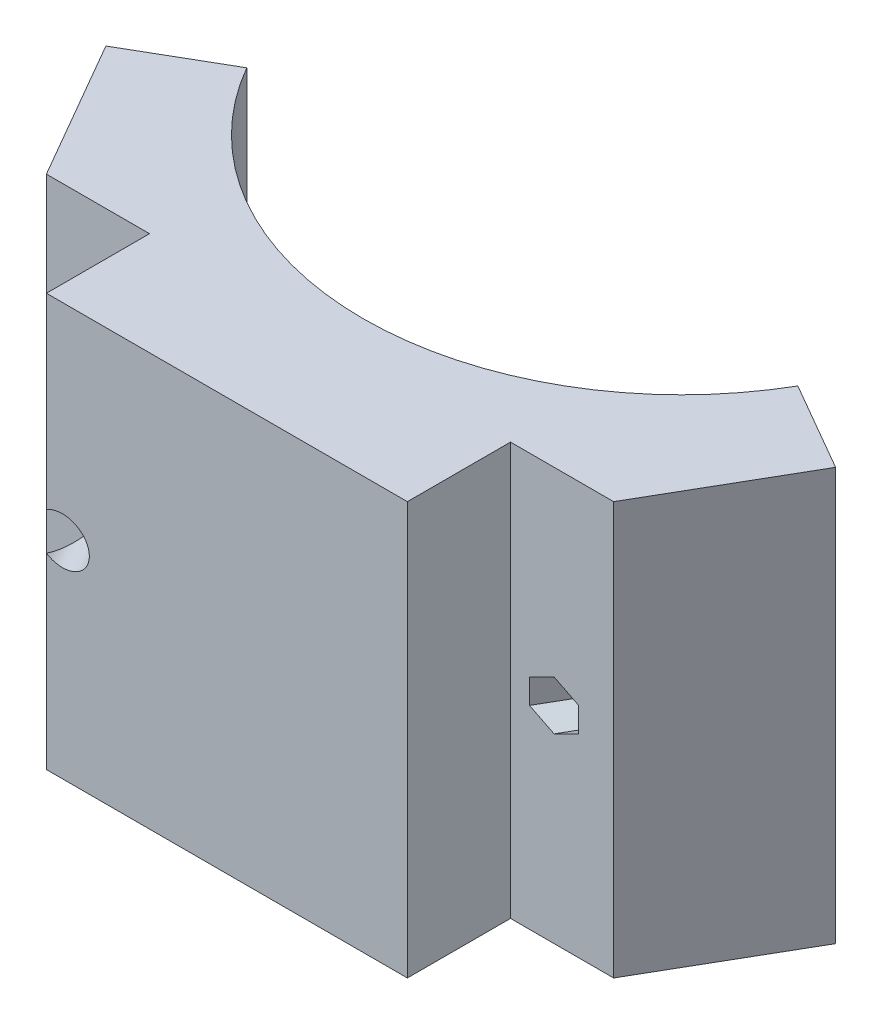
ISO-10303-21;
HEADER;
FILE_DESCRIPTION(('STEP AP214'),'2;1');
FILE_NAME('part.step','',(''),(''),'','','');
FILE_SCHEMA(('AUTOMOTIVE_DESIGN { 1 0 10303 214 1 1 1 1 }'));
ENDSEC;
DATA;
#1=APPLICATION_CONTEXT('core data for automotive mechanical design processes');
#2=APPLICATION_PROTOCOL_DEFINITION('international standard','automotive_design',2000,#1);
#3=PRODUCT_CONTEXT('',#1,'mechanical');
#4=PRODUCT('Part','Part','',(#3));
#5=PRODUCT_RELATED_PRODUCT_CATEGORY('part','',(#4));
#6=PRODUCT_DEFINITION_FORMATION('','',#4);
#7=PRODUCT_DEFINITION_CONTEXT('part definition',#1,'design');
#8=PRODUCT_DEFINITION('design','',#6,#7);
#9=PRODUCT_DEFINITION_SHAPE('','',#8);
#10=(LENGTH_UNIT() NAMED_UNIT(*) SI_UNIT(.MILLI.,.METRE.));
#11=(NAMED_UNIT(*) PLANE_ANGLE_UNIT() SI_UNIT($,.RADIAN.));
#12=(NAMED_UNIT(*) SI_UNIT($,.STERADIAN.) SOLID_ANGLE_UNIT());
#13=UNCERTAINTY_MEASURE_WITH_UNIT(LENGTH_MEASURE(1.E-05),#10,'distance_accuracy_value','');
#14=(GEOMETRIC_REPRESENTATION_CONTEXT(3) GLOBAL_UNCERTAINTY_ASSIGNED_CONTEXT((#13)) GLOBAL_UNIT_ASSIGNED_CONTEXT((#10,
#11,#12)) REPRESENTATION_CONTEXT('',''));
#15=CARTESIAN_POINT('',(0.,0.,0.));
#16=DIRECTION('',(0.,0.,1.));
#17=DIRECTION('',(1.,0.,0.));
#18=AXIS2_PLACEMENT_3D('',#15,#16,#17);
#19=CARTESIAN_POINT('',(0.,50.8,0.));
#20=DIRECTION('',(0.,-1.,0.));
#21=DIRECTION('',(0.,0.,-1.));
#22=AXIS2_PLACEMENT_3D('',#19,#20,#21);
#23=CYLINDRICAL_SURFACE('',#22,78.359);
#24=CARTESIAN_POINT('',(0.,-50.8,0.));
#25=DIRECTION('',(0.,1.,0.));
#26=DIRECTION('',(0.,0.,1.));
#27=AXIS2_PLACEMENT_3D('',#24,#25,#26);
#28=CIRCLE('',#27,78.359);
#29=CARTESIAN_POINT('',(-67.8608846151449,-50.8,39.1794999999998));
#30=VERTEX_POINT('',#29);
#31=CARTESIAN_POINT('',(67.8608846151449,-50.8,39.1794999999998));
#32=VERTEX_POINT('',#31);
#33=EDGE_CURVE('E289',#30,#32,#28,.T.);
#34=ORIENTED_EDGE('',*,*,#33,.F.);
#35=DIRECTION('',(0.,-1.,0.));
#36=VECTOR('',#35,1.);
#37=CARTESIAN_POINT('',(-67.8608846151449,50.8,39.1794999999998));
#38=LINE('',#37,#36);
#39=CARTESIAN_POINT('',(-67.8608846151449,50.8,39.1794999999998));
#40=VERTEX_POINT('',#39);
#41=EDGE_CURVE('E53',#40,#30,#38,.T.);
#42=ORIENTED_EDGE('',*,*,#41,.F.);
#43=CARTESIAN_POINT('',(0.,50.8,0.));
#44=DIRECTION('',(0.,1.,0.));
#45=DIRECTION('',(0.,0.,1.));
#46=AXIS2_PLACEMENT_3D('',#43,#44,#45);
#47=CIRCLE('',#46,78.359);
#48=CARTESIAN_POINT('',(67.8608846151449,50.8,39.1794999999998));
#49=VERTEX_POINT('',#48);
#50=EDGE_CURVE('E290',#40,#49,#47,.T.);
#51=ORIENTED_EDGE('',*,*,#50,.T.);
#52=DIRECTION('',(0.,-1.,0.));
#53=VECTOR('',#52,1.);
#54=CARTESIAN_POINT('',(67.8608846151449,50.8,39.1794999999998));
#55=LINE('',#54,#53);
#56=EDGE_CURVE('E325',#49,#32,#55,.T.);
#57=ORIENTED_EDGE('',*,*,#56,.T.);
#58=EDGE_LOOP('',(#34,#42,#51,#57));
#59=FACE_BOUND('',#58,.T.);
#60=ADVANCED_FACE('F45',(#59),#23,.F.);
#61=CARTESIAN_POINT('',(0.,50.8,-1.62249976663613E-13));
#62=DIRECTION('',(0.5,0.,0.866025403784439));
#63=DIRECTION('',(0.866025403784439,0.,-0.5));
#64=AXIS2_PLACEMENT_3D('',#61,#62,#63);
#65=PLANE('',#64);
#66=CARTESIAN_POINT('',(-78.8594072432072,0.,45.5295));
#67=DIRECTION('',(-0.5,0.,-0.866025403784439));
#68=DIRECTION('',(-0.866025403784439,0.,0.5));
#69=AXIS2_PLACEMENT_3D('',#66,#67,#68);
#70=CIRCLE('',#69,3.50000000000001);
#71=CARTESIAN_POINT('',(-81.8904961564528,0.,47.2795));
#72=VERTEX_POINT('',#71);
#73=EDGE_CURVE('E213',#72,#72,#70,.T.);
#74=ORIENTED_EDGE('',*,*,#73,.F.);
#75=EDGE_LOOP('',(#74));
#76=FACE_BOUND('',#75,.T.);
#77=DIRECTION('',(-0.866025403784439,0.,0.5));
#78=VECTOR('',#77,1.);
#79=CARTESIAN_POINT('',(0.,-50.8,-1.62249976663613E-13));
#80=LINE('',#79,#78);
#81=CARTESIAN_POINT('',(-89.8579298712697,-50.8,51.8794999999998));
#82=VERTEX_POINT('',#81);
#83=EDGE_CURVE('E329',#30,#82,#80,.T.);
#84=ORIENTED_EDGE('',*,*,#83,.T.);
#85=DIRECTION('',(0.,-1.,0.));
#86=VECTOR('',#85,1.);
#87=CARTESIAN_POINT('',(-89.8579298712697,50.8,51.8794999999998));
#88=LINE('',#87,#86);
#89=CARTESIAN_POINT('',(-89.8579298712697,50.8,51.8794999999998));
#90=VERTEX_POINT('',#89);
#91=EDGE_CURVE('E194',#90,#82,#88,.T.);
#92=ORIENTED_EDGE('',*,*,#91,.F.);
#93=DIRECTION('',(-0.866025403784439,0.,0.5));
#94=VECTOR('',#93,1.);
#95=CARTESIAN_POINT('',(0.,50.8,-1.62249976663613E-13));
#96=LINE('',#95,#94);
#97=EDGE_CURVE('E294',#40,#90,#96,.T.);
#98=ORIENTED_EDGE('',*,*,#97,.F.);
#99=ORIENTED_EDGE('',*,*,#41,.T.);
#100=EDGE_LOOP('',(#84,#92,#98,#99));
#101=FACE_BOUND('',#100,.T.);
#102=ADVANCED_FACE('F399',(#76,#101),#65,.F.);
#103=CARTESIAN_POINT('',(-89.8579298712696,50.8,51.8795));
#104=DIRECTION('',(0.866025403784439,0.,-0.5));
#105=DIRECTION('',(-0.5,0.,-0.866025403784439));
#106=AXIS2_PLACEMENT_3D('',#103,#104,#105);
#107=PLANE('',#106);
#108=DIRECTION('',(0.5,0.,0.866025403784439));
#109=VECTOR('',#108,1.);
#110=CARTESIAN_POINT('',(-89.8579298712696,-50.8,51.8795));
#111=LINE('',#110,#109);
#112=CARTESIAN_POINT('',(-69.85,-50.8,86.5342510913139));
#113=VERTEX_POINT('',#112);
#114=EDGE_CURVE('E332',#82,#113,#111,.T.);
#115=ORIENTED_EDGE('',*,*,#114,.T.);
#116=DIRECTION('',(0.,-1.,0.));
#117=VECTOR('',#116,1.);
#118=CARTESIAN_POINT('',(-69.85,50.8,86.5342510913139));
#119=LINE('',#118,#117);
#120=CARTESIAN_POINT('',(-69.85,50.8,86.5342510913139));
#121=VERTEX_POINT('',#120);
#122=EDGE_CURVE('E185',#121,#113,#119,.T.);
#123=ORIENTED_EDGE('',*,*,#122,.F.);
#124=DIRECTION('',(0.5,0.,0.866025403784439));
#125=VECTOR('',#124,1.);
#126=CARTESIAN_POINT('',(-89.8579298712696,50.8,51.8795));
#127=LINE('',#126,#125);
#128=EDGE_CURVE('E298',#90,#121,#127,.T.);
#129=ORIENTED_EDGE('',*,*,#128,.F.);
#130=ORIENTED_EDGE('',*,*,#91,.T.);
#131=EDGE_LOOP('',(#115,#123,#129,#130));
#132=FACE_BOUND('',#131,.T.);
#133=ADVANCED_FACE('F404',(#132),#107,.F.);
#134=CARTESIAN_POINT('',(0.,50.8,86.5342510913139));
#135=DIRECTION('',(0.,0.,-1.));
#136=DIRECTION('',(-1.,0.,0.));
#137=AXIS2_PLACEMENT_3D('',#134,#135,#136);
#138=PLANE('',#137);
#139=CARTESIAN_POINT('',(-55.1853031625835,0.,86.5342510913139));
#140=DIRECTION('',(0.,0.,-1.));
#141=DIRECTION('',(-1.,0.,0.));
#142=AXIS2_PLACEMENT_3D('',#139,#140,#141);
#143=ELLIPSE('',#142,6.63952809568071,5.75000000000001);
#144=CARTESIAN_POINT('',(-61.8248312582642,0.,86.5342510913139));
#145=VERTEX_POINT('',#144);
#146=EDGE_CURVE('E173',#145,#145,#143,.T.);
#147=ORIENTED_EDGE('',*,*,#146,.T.);
#148=EDGE_LOOP('',(#147));
#149=FACE_BOUND('',#148,.T.);
#150=DIRECTION('',(1.,0.,0.));
#151=VECTOR('',#150,1.);
#152=CARTESIAN_POINT('',(0.,-50.8,86.5342510913139));
#153=LINE('',#152,#151);
#154=CARTESIAN_POINT('',(-44.45,-50.8,86.5342510913139));
#155=VERTEX_POINT('',#154);
#156=EDGE_CURVE('E335',#113,#155,#153,.T.);
#157=ORIENTED_EDGE('',*,*,#156,.T.);
#158=DIRECTION('',(0.,-1.,0.));
#159=VECTOR('',#158,1.);
#160=CARTESIAN_POINT('',(-44.45,50.8,86.5342510913139));
#161=LINE('',#160,#159);
#162=CARTESIAN_POINT('',(-44.45,50.8,86.5342510913139));
#163=VERTEX_POINT('',#162);
#164=EDGE_CURVE('E180',#163,#155,#161,.T.);
#165=ORIENTED_EDGE('',*,*,#164,.F.);
#166=DIRECTION('',(1.,0.,0.));
#167=VECTOR('',#166,1.);
#168=CARTESIAN_POINT('',(0.,50.8,86.5342510913139));
#169=LINE('',#168,#167);
#170=EDGE_CURVE('E301',#121,#163,#169,.T.);
#171=ORIENTED_EDGE('',*,*,#170,.F.);
#172=ORIENTED_EDGE('',*,*,#122,.T.);
#173=EDGE_LOOP('',(#157,#165,#171,#172));
#174=FACE_BOUND('',#173,.T.);
#175=ADVANCED_FACE('F408',(#149,#174),#138,.F.);
#176=CARTESIAN_POINT('',(-44.45,50.8,0.));
#177=DIRECTION('',(1.,0.,0.));
#178=DIRECTION('',(0.,0.,-1.));
#179=AXIS2_PLACEMENT_3D('',#176,#177,#178);
#180=PLANE('',#179);
#181=DIRECTION('',(0.,-1.,0.));
#182=VECTOR('',#181,1.);
#183=CARTESIAN_POINT('',(-44.45,50.8,111.934251091314));
#184=LINE('',#183,#182);
#185=CARTESIAN_POINT('',(-44.45,-4.63491089570633,111.934251091314));
#186=VERTEX_POINT('',#185);
#187=CARTESIAN_POINT('',(-44.45,-50.8,111.934251091314));
#188=VERTEX_POINT('',#187);
#189=EDGE_CURVE('E171',#186,#188,#184,.T.);
#190=ORIENTED_EDGE('',*,*,#189,.F.);
#191=CARTESIAN_POINT('',(-44.45,0.,105.128341603563));
#192=DIRECTION('',(1.,0.,0.));
#193=DIRECTION('',(0.,0.,-1.));
#194=AXIS2_PLACEMENT_3D('',#191,#192,#193);
#195=ELLIPSE('',#194,11.5,5.75000000000001);
#196=CARTESIAN_POINT('',(-44.45,4.63491089570633,111.934251091314));
#197=VERTEX_POINT('',#196);
#198=EDGE_CURVE('E59',#186,#197,#195,.T.);
#199=ORIENTED_EDGE('',*,*,#198,.T.);
#200=CARTESIAN_POINT('',(-44.45,50.8,111.934251091314));
#201=VERTEX_POINT('',#200);
#202=EDGE_CURVE('E168',#201,#197,#184,.T.);
#203=ORIENTED_EDGE('',*,*,#202,.F.);
#204=DIRECTION('',(0.,0.,1.));
#205=VECTOR('',#204,1.);
#206=CARTESIAN_POINT('',(-44.45,50.8,0.));
#207=LINE('',#206,#205);
#208=EDGE_CURVE('E304',#163,#201,#207,.T.);
#209=ORIENTED_EDGE('',*,*,#208,.F.);
#210=ORIENTED_EDGE('',*,*,#164,.T.);
#211=DIRECTION('',(0.,0.,1.));
#212=VECTOR('',#211,1.);
#213=CARTESIAN_POINT('',(-44.45,-50.8,0.));
#214=LINE('',#213,#212);
#215=EDGE_CURVE('E338',#155,#188,#214,.T.);
#216=ORIENTED_EDGE('',*,*,#215,.T.);
#217=EDGE_LOOP('',(#190,#199,#203,#209,#210,#216));
#218=FACE_BOUND('',#217,.T.);
#219=ADVANCED_FACE('F166',(#218),#180,.F.);
#220=CARTESIAN_POINT('',(0.,50.8,111.934251091314));
#221=DIRECTION('',(0.,0.,-1.));
#222=DIRECTION('',(-1.,0.,0.));
#223=AXIS2_PLACEMENT_3D('',#220,#221,#222);
#224=PLANE('',#223);
#225=ORIENTED_EDGE('',*,*,#202,.T.);
#226=CARTESIAN_POINT('',(-40.5206063251671,0.,111.934251091314));
#227=DIRECTION('',(0.,0.,-1.));
#228=DIRECTION('',(-1.,0.,0.));
#229=AXIS2_PLACEMENT_3D('',#226,#227,#228);
#230=ELLIPSE('',#229,6.63952809568071,5.75000000000001);
#231=EDGE_CURVE('E11',#197,#186,#230,.T.);
#232=ORIENTED_EDGE('',*,*,#231,.T.);
#233=ORIENTED_EDGE('',*,*,#189,.T.);
#234=DIRECTION('',(1.,0.,0.));
#235=VECTOR('',#234,1.);
#236=CARTESIAN_POINT('',(0.,-50.8,111.934251091314));
#237=LINE('',#236,#235);
#238=CARTESIAN_POINT('',(44.45,-50.8,111.934251091314));
#239=VERTEX_POINT('',#238);
#240=EDGE_CURVE('E341',#188,#239,#237,.T.);
#241=ORIENTED_EDGE('',*,*,#240,.T.);
#242=DIRECTION('',(0.,-1.,0.));
#243=VECTOR('',#242,1.);
#244=CARTESIAN_POINT('',(44.45,50.8,111.934251091314));
#245=LINE('',#244,#243);
#246=CARTESIAN_POINT('',(44.45,50.8,111.934251091314));
#247=VERTEX_POINT('',#246);
#248=EDGE_CURVE('E187',#247,#239,#245,.T.);
#249=ORIENTED_EDGE('',*,*,#248,.F.);
#250=DIRECTION('',(1.,0.,0.));
#251=VECTOR('',#250,1.);
#252=CARTESIAN_POINT('',(0.,50.8,111.934251091314));
#253=LINE('',#252,#251);
#254=EDGE_CURVE('E178',#201,#247,#253,.T.);
#255=ORIENTED_EDGE('',*,*,#254,.F.);
#256=EDGE_LOOP('',(#225,#232,#233,#241,#249,#255));
#257=FACE_BOUND('',#256,.T.);
#258=ADVANCED_FACE('F176',(#257),#224,.F.);
#259=CARTESIAN_POINT('',(44.45,50.8,0.));
#260=DIRECTION('',(1.,0.,0.));
#261=DIRECTION('',(0.,0.,-1.));
#262=AXIS2_PLACEMENT_3D('',#259,#260,#261);
#263=PLANE('',#262);
#264=DIRECTION('',(0.,0.,1.));
#265=VECTOR('',#264,1.);
#266=CARTESIAN_POINT('',(44.45,-50.8,0.));
#267=LINE('',#266,#265);
#268=CARTESIAN_POINT('',(44.45,-50.8,86.5342510913139));
#269=VERTEX_POINT('',#268);
#270=EDGE_CURVE('E345',#269,#239,#267,.T.);
#271=ORIENTED_EDGE('',*,*,#270,.F.);
#272=DIRECTION('',(0.,-1.,0.));
#273=VECTOR('',#272,1.);
#274=CARTESIAN_POINT('',(44.45,50.8,86.5342510913139));
#275=LINE('',#274,#273);
#276=CARTESIAN_POINT('',(44.45,50.8,86.5342510913139));
#277=VERTEX_POINT('',#276);
#278=EDGE_CURVE('E367',#277,#269,#275,.T.);
#279=ORIENTED_EDGE('',*,*,#278,.F.);
#280=DIRECTION('',(0.,0.,1.));
#281=VECTOR('',#280,1.);
#282=CARTESIAN_POINT('',(44.45,50.8,0.));
#283=LINE('',#282,#281);
#284=EDGE_CURVE('E309',#277,#247,#283,.T.);
#285=ORIENTED_EDGE('',*,*,#284,.T.);
#286=ORIENTED_EDGE('',*,*,#248,.T.);
#287=EDGE_LOOP('',(#271,#279,#285,#286));
#288=FACE_BOUND('',#287,.T.);
#289=ADVANCED_FACE('F374',(#288),#263,.T.);
#290=CARTESIAN_POINT('',(0.,50.8,86.5342510913139));
#291=DIRECTION('',(0.,0.,1.));
#292=DIRECTION('',(1.,0.,0.));
#293=AXIS2_PLACEMENT_3D('',#290,#291,#292);
#294=PLANE('',#293);
#295=DIRECTION('',(0.,1.,0.));
#296=VECTOR('',#295,1.);
#297=CARTESIAN_POINT('',(49.1231253360926,-3.03108891324552,86.5342510913139));
#298=LINE('',#297,#296);
#299=CARTESIAN_POINT('',(49.1231253360926,-3.03108891324552,86.5342510913139));
#300=VERTEX_POINT('',#299);
#301=CARTESIAN_POINT('',(49.1231253360926,3.03108891324553,86.5342510913139));
#302=VERTEX_POINT('',#301);
#303=EDGE_CURVE('E217',#300,#302,#298,.T.);
#304=ORIENTED_EDGE('',*,*,#303,.T.);
#305=DIRECTION('',(0.894427190999916,0.447213595499958,0.));
#306=VECTOR('',#305,1.);
#307=CARTESIAN_POINT('',(43.4237060794313,0.181379284914886,86.5342510913139));
#308=LINE('',#307,#306);
#309=CARTESIAN_POINT('',(55.1853031625836,6.06217782649107,86.5342510913139));
#310=VERTEX_POINT('',#309);
#311=EDGE_CURVE('E246',#302,#310,#308,.T.);
#312=ORIENTED_EDGE('',*,*,#311,.T.);
#313=DIRECTION('',(0.894427190999916,-0.447213595499958,0.));
#314=VECTOR('',#313,1.);
#315=CARTESIAN_POINT('',(48.2734483406241,9.51810523747082,86.5342510913139));
#316=LINE('',#315,#314);
#317=CARTESIAN_POINT('',(61.2474809890747,3.03108891324554,86.5342510913139));
#318=VERTEX_POINT('',#317);
#319=EDGE_CURVE('E270',#310,#318,#316,.T.);
#320=ORIENTED_EDGE('',*,*,#319,.T.);
#321=DIRECTION('',(0.,-1.,0.));
#322=VECTOR('',#321,1.);
#323=CARTESIAN_POINT('',(61.2474809890747,3.03108891324554,86.5342510913139));
#324=LINE('',#323,#322);
#325=CARTESIAN_POINT('',(61.2474809890747,-3.03108891324556,86.5342510913139));
#326=VERTEX_POINT('',#325);
#327=EDGE_CURVE('E265',#318,#326,#324,.T.);
#328=ORIENTED_EDGE('',*,*,#327,.T.);
#329=DIRECTION('',(-0.894427190999916,-0.447213595499957,0.));
#330=VECTOR('',#329,1.);
#331=CARTESIAN_POINT('',(53.123190601817,-7.09323410687441,86.5342510913139));
#332=LINE('',#331,#330);
#333=CARTESIAN_POINT('',(55.1853031625836,-6.06217782649108,86.5342510913139));
#334=VERTEX_POINT('',#333);
#335=EDGE_CURVE('E260',#326,#334,#332,.T.);
#336=ORIENTED_EDGE('',*,*,#335,.T.);
#337=DIRECTION('',(-0.894427190999915,0.447213595499959,0.));
#338=VECTOR('',#337,1.);
#339=CARTESIAN_POINT('',(48.2734483406241,-2.60625041551132,86.5342510913139));
#340=LINE('',#339,#338);
#341=EDGE_CURVE('E255',#334,#300,#340,.T.);
#342=ORIENTED_EDGE('',*,*,#341,.T.);
#343=EDGE_LOOP('',(#304,#312,#320,#328,#336,#342));
#344=FACE_BOUND('',#343,.T.);
#345=DIRECTION('',(-1.,0.,0.));
#346=VECTOR('',#345,1.);
#347=CARTESIAN_POINT('',(0.,-50.8,86.5342510913139));
#348=LINE('',#347,#346);
#349=CARTESIAN_POINT('',(69.85,-50.8,86.5342510913139));
#350=VERTEX_POINT('',#349);
#351=EDGE_CURVE('E349',#350,#269,#348,.T.);
#352=ORIENTED_EDGE('',*,*,#351,.F.);
#353=DIRECTION('',(0.,-1.,0.));
#354=VECTOR('',#353,1.);
#355=CARTESIAN_POINT('',(69.85,50.8,86.5342510913139));
#356=LINE('',#355,#354);
#357=CARTESIAN_POINT('',(69.85,50.8,86.5342510913139));
#358=VERTEX_POINT('',#357);
#359=EDGE_CURVE('E365',#358,#350,#356,.T.);
#360=ORIENTED_EDGE('',*,*,#359,.F.);
#361=DIRECTION('',(-1.,0.,0.));
#362=VECTOR('',#361,1.);
#363=CARTESIAN_POINT('',(0.,50.8,86.5342510913139));
#364=LINE('',#363,#362);
#365=EDGE_CURVE('E313',#358,#277,#364,.T.);
#366=ORIENTED_EDGE('',*,*,#365,.T.);
#367=ORIENTED_EDGE('',*,*,#278,.T.);
#368=EDGE_LOOP('',(#352,#360,#366,#367));
#369=FACE_BOUND('',#368,.T.);
#370=ADVANCED_FACE('F381',(#344,#369),#294,.T.);
#371=CARTESIAN_POINT('',(89.8579298712696,50.8,51.8795));
#372=DIRECTION('',(0.866025403784439,0.,0.5));
#373=DIRECTION('',(0.5,0.,-0.866025403784439));
#374=AXIS2_PLACEMENT_3D('',#371,#372,#373);
#375=PLANE('',#374);
#376=DIRECTION('',(-0.5,0.,0.866025403784439));
#377=VECTOR('',#376,1.);
#378=CARTESIAN_POINT('',(89.8579298712696,-50.8,51.8795));
#379=LINE('',#378,#377);
#380=CARTESIAN_POINT('',(89.8579298712697,-50.8,51.8794999999998));
#381=VERTEX_POINT('',#380);
#382=EDGE_CURVE('E353',#381,#350,#379,.T.);
#383=ORIENTED_EDGE('',*,*,#382,.F.);
#384=DIRECTION('',(0.,-1.,0.));
#385=VECTOR('',#384,1.);
#386=CARTESIAN_POINT('',(89.8579298712697,50.8,51.8794999999998));
#387=LINE('',#386,#385);
#388=CARTESIAN_POINT('',(89.8579298712697,50.8,51.8794999999998));
#389=VERTEX_POINT('',#388);
#390=EDGE_CURVE('E362',#389,#381,#387,.T.);
#391=ORIENTED_EDGE('',*,*,#390,.F.);
#392=DIRECTION('',(-0.5,0.,0.866025403784439));
#393=VECTOR('',#392,1.);
#394=CARTESIAN_POINT('',(89.8579298712696,50.8,51.8795));
#395=LINE('',#394,#393);
#396=EDGE_CURVE('E317',#389,#358,#395,.T.);
#397=ORIENTED_EDGE('',*,*,#396,.T.);
#398=ORIENTED_EDGE('',*,*,#359,.T.);
#399=EDGE_LOOP('',(#383,#391,#397,#398));
#400=FACE_BOUND('',#399,.T.);
#401=ADVANCED_FACE('F389',(#400),#375,.T.);
#402=CARTESIAN_POINT('',(0.,50.8,-1.62249976663613E-13));
#403=DIRECTION('',(0.5,0.,-0.866025403784439));
#404=DIRECTION('',(-0.866025403784439,0.,-0.5));
#405=AXIS2_PLACEMENT_3D('',#402,#403,#404);
#406=PLANE('',#405);
#407=CARTESIAN_POINT('',(78.8594072432073,0.,45.5294999999999));
#408=DIRECTION('',(0.499999999999999,0.,-0.866025403784439));
#409=DIRECTION('',(-0.866025403784439,0.,-0.499999999999999));
#410=AXIS2_PLACEMENT_3D('',#407,#408,#409);
#411=CIRCLE('',#410,3.50000000000001);
#412=CARTESIAN_POINT('',(75.8283183299617,0.,43.7794999999999));
#413=VERTEX_POINT('',#412);
#414=EDGE_CURVE('E222',#413,#413,#411,.T.);
#415=ORIENTED_EDGE('',*,*,#414,.F.);
#416=EDGE_LOOP('',(#415));
#417=FACE_BOUND('',#416,.T.);
#418=DIRECTION('',(0.866025403784439,0.,0.5));
#419=VECTOR('',#418,1.);
#420=CARTESIAN_POINT('',(0.,-50.8,-1.62249976663613E-13));
#421=LINE('',#420,#419);
#422=EDGE_CURVE('E295',#32,#381,#421,.T.);
#423=ORIENTED_EDGE('',*,*,#422,.F.);
#424=ORIENTED_EDGE('',*,*,#56,.F.);
#425=DIRECTION('',(0.866025403784439,0.,0.5));
#426=VECTOR('',#425,1.);
#427=CARTESIAN_POINT('',(0.,50.8,-1.62249976663613E-13));
#428=LINE('',#427,#426);
#429=EDGE_CURVE('E321',#49,#389,#428,.T.);
#430=ORIENTED_EDGE('',*,*,#429,.T.);
#431=ORIENTED_EDGE('',*,*,#390,.T.);
#432=EDGE_LOOP('',(#423,#424,#430,#431));
#433=FACE_BOUND('',#432,.T.);
#434=ADVANCED_FACE('F392',(#417,#433),#406,.T.);
#435=CARTESIAN_POINT('',(0.,50.8,0.));
#436=DIRECTION('',(0.,1.,0.));
#437=DIRECTION('',(0.,0.,1.));
#438=AXIS2_PLACEMENT_3D('',#435,#436,#437);
#439=PLANE('',#438);
#440=ORIENTED_EDGE('',*,*,#50,.F.);
#441=ORIENTED_EDGE('',*,*,#97,.T.);
#442=ORIENTED_EDGE('',*,*,#128,.T.);
#443=ORIENTED_EDGE('',*,*,#170,.T.);
#444=ORIENTED_EDGE('',*,*,#208,.T.);
#445=ORIENTED_EDGE('',*,*,#254,.T.);
#446=ORIENTED_EDGE('',*,*,#284,.F.);
#447=ORIENTED_EDGE('',*,*,#365,.F.);
#448=ORIENTED_EDGE('',*,*,#396,.F.);
#449=ORIENTED_EDGE('',*,*,#429,.F.);
#450=EDGE_LOOP('',(#440,#441,#442,#443,#444,#445,#446,#447,#448,#449));
#451=FACE_BOUND('',#450,.T.);
#452=ADVANCED_FACE('F387',(#451),#439,.T.);
#453=CARTESIAN_POINT('',(0.,-50.8,0.));
#454=DIRECTION('',(0.,1.,0.));
#455=DIRECTION('',(0.,0.,1.));
#456=AXIS2_PLACEMENT_3D('',#453,#454,#455);
#457=PLANE('',#456);
#458=ORIENTED_EDGE('',*,*,#33,.T.);
#459=ORIENTED_EDGE('',*,*,#422,.T.);
#460=ORIENTED_EDGE('',*,*,#382,.T.);
#461=ORIENTED_EDGE('',*,*,#351,.T.);
#462=ORIENTED_EDGE('',*,*,#270,.T.);
#463=ORIENTED_EDGE('',*,*,#240,.F.);
#464=ORIENTED_EDGE('',*,*,#215,.F.);
#465=ORIENTED_EDGE('',*,*,#156,.F.);
#466=ORIENTED_EDGE('',*,*,#114,.F.);
#467=ORIENTED_EDGE('',*,*,#83,.F.);
#468=EDGE_LOOP('',(#458,#459,#460,#461,#462,#463,#464,#465,#466,#467));
#469=FACE_BOUND('',#468,.T.);
#470=ADVANCED_FACE('F379',(#469),#457,.F.);
#471=CARTESIAN_POINT('',(52.5014773719377,0.,91.1827737193763));
#472=DIRECTION('',(0.499999999999999,0.,-0.866025403784439));
#473=DIRECTION('',(-0.866025403784439,0.,-0.499999999999999));
#474=AXIS2_PLACEMENT_3D('',#471,#472,#473);
#475=CYLINDRICAL_SURFACE('',#474,3.50000000000001);
#476=CARTESIAN_POINT('',(76.3594072432073,0.,49.8596270189221));
#477=DIRECTION('',(0.499999999999999,0.,-0.866025403784439));
#478=DIRECTION('',(-0.866025403784439,0.,-0.499999999999999));
#479=AXIS2_PLACEMENT_3D('',#476,#477,#478);
#480=CIRCLE('',#479,3.50000000000001);
#481=CARTESIAN_POINT('',(73.3283183299617,0.,48.1096270189221));
#482=VERTEX_POINT('',#481);
#483=EDGE_CURVE('E242',#482,#482,#480,.T.);
#484=ORIENTED_EDGE('',*,*,#483,.F.);
#485=EDGE_LOOP('',(#484));
#486=FACE_BOUND('',#485,.T.);
#487=ORIENTED_EDGE('',*,*,#414,.T.);
#488=EDGE_LOOP('',(#487));
#489=FACE_BOUND('',#488,.T.);
#490=ADVANCED_FACE('F466',(#486,#489),#475,.F.);
#491=CARTESIAN_POINT('',(41.9988512652659,-3.03108891324552,98.8738557490312));
#492=DIRECTION('',(-0.866025403784439,0.,-0.499999999999998));
#493=DIRECTION('',(-0.499999999999999,0.,0.86602540378444));
#494=AXIS2_PLACEMENT_3D('',#491,#492,#493);
#495=PLANE('',#494);
#496=DIRECTION('',(0.499999999999998,0.,-0.866025403784439));
#497=VECTOR('',#496,1.);
#498=CARTESIAN_POINT('',(41.9988512652659,-3.03108891324552,98.8738557490312));
#499=LINE('',#498,#497);
#500=CARTESIAN_POINT('',(71.812773873339,-3.03108891324552,47.2346270189221));
#501=VERTEX_POINT('',#500);
#502=EDGE_CURVE('E259',#300,#501,#499,.T.);
#503=ORIENTED_EDGE('',*,*,#502,.T.);
#504=DIRECTION('',(0.,1.,0.));
#505=VECTOR('',#504,1.);
#506=CARTESIAN_POINT('',(71.812773873339,-3.03108891324552,47.2346270189221));
#507=LINE('',#506,#505);
#508=CARTESIAN_POINT('',(71.812773873339,3.03108891324553,47.2346270189221));
#509=VERTEX_POINT('',#508);
#510=EDGE_CURVE('E238',#501,#509,#507,.T.);
#511=ORIENTED_EDGE('',*,*,#510,.T.);
#512=DIRECTION('',(0.499999999999998,0.,-0.866025403784439));
#513=VECTOR('',#512,1.);
#514=CARTESIAN_POINT('',(41.9988512652659,3.03108891324553,98.8738557490312));
#515=LINE('',#514,#513);
#516=EDGE_CURVE('E254',#302,#509,#515,.T.);
#517=ORIENTED_EDGE('',*,*,#516,.F.);
#518=ORIENTED_EDGE('',*,*,#303,.F.);
#519=EDGE_LOOP('',(#503,#511,#517,#518));
#520=FACE_BOUND('',#519,.T.);
#521=ADVANCED_FACE('F462',(#520),#495,.F.);
#522=CARTESIAN_POINT('',(46.5454846351343,-6.06217782649108,101.498855749031));
#523=DIRECTION('',(-0.433012701892221,-0.866025403784438,-0.25));
#524=DIRECTION('',(0.894427190999915,-0.447213595499959,0.));
#525=AXIS2_PLACEMENT_3D('',#522,#523,#524);
#526=PLANE('',#525);
#527=DIRECTION('',(0.499999999999998,0.,-0.866025403784439));
#528=VECTOR('',#527,1.);
#529=CARTESIAN_POINT('',(46.5454846351343,-6.06217782649108,101.498855749031));
#530=LINE('',#529,#528);
#531=CARTESIAN_POINT('',(76.3594072432073,-6.06217782649108,49.8596270189221));
#532=VERTEX_POINT('',#531);
#533=EDGE_CURVE('E264',#334,#532,#530,.T.);
#534=ORIENTED_EDGE('',*,*,#533,.T.);
#535=DIRECTION('',(-0.75,0.500000000000001,-0.433012701892219));
#536=VECTOR('',#535,1.);
#537=CARTESIAN_POINT('',(76.3594072432073,-6.06217782649108,49.8596270189221));
#538=LINE('',#537,#536);
#539=EDGE_CURVE('E218',#532,#501,#538,.T.);
#540=ORIENTED_EDGE('',*,*,#539,.T.);
#541=ORIENTED_EDGE('',*,*,#502,.F.);
#542=ORIENTED_EDGE('',*,*,#341,.F.);
#543=EDGE_LOOP('',(#534,#540,#541,#542));
#544=FACE_BOUND('',#543,.T.);
#545=ADVANCED_FACE('F458',(#544),#526,.F.);
#546=CARTESIAN_POINT('',(51.0921180050026,-3.03108891324556,104.123855749031));
#547=DIRECTION('',(0.433012701892219,-0.866025403784439,0.249999999999999));
#548=DIRECTION('',(0.894427190999916,0.447213595499957,0.));
#549=AXIS2_PLACEMENT_3D('',#546,#547,#548);
#550=PLANE('',#549);
#551=DIRECTION('',(0.499999999999998,0.,-0.866025403784439));
#552=VECTOR('',#551,1.);
#553=CARTESIAN_POINT('',(51.0921180050026,-3.03108891324556,104.123855749031));
#554=LINE('',#553,#552);
#555=CARTESIAN_POINT('',(80.9060406130756,-3.03108891324556,52.4846270189221));
#556=VERTEX_POINT('',#555);
#557=EDGE_CURVE('E269',#326,#556,#554,.T.);
#558=ORIENTED_EDGE('',*,*,#557,.T.);
#559=DIRECTION('',(-0.750000000000002,-0.499999999999999,-0.433012701892218));
#560=VECTOR('',#559,1.);
#561=CARTESIAN_POINT('',(80.9060406130756,-3.03108891324556,52.4846270189221));
#562=LINE('',#561,#560);
#563=EDGE_CURVE('E223',#556,#532,#562,.T.);
#564=ORIENTED_EDGE('',*,*,#563,.T.);
#565=ORIENTED_EDGE('',*,*,#533,.F.);
#566=ORIENTED_EDGE('',*,*,#335,.F.);
#567=EDGE_LOOP('',(#558,#564,#565,#566));
#568=FACE_BOUND('',#567,.T.);
#569=ADVANCED_FACE('F454',(#568),#550,.F.);
#570=CARTESIAN_POINT('',(51.0921180050026,3.03108891324554,104.123855749031));
#571=DIRECTION('',(0.866025403784439,0.,0.499999999999998));
#572=DIRECTION('',(0.499999999999999,0.,-0.86602540378444));
#573=AXIS2_PLACEMENT_3D('',#570,#571,#572);
#574=PLANE('',#573);
#575=DIRECTION('',(0.499999999999998,0.,-0.866025403784439));
#576=VECTOR('',#575,1.);
#577=CARTESIAN_POINT('',(51.0921180050026,3.03108891324554,104.123855749031));
#578=LINE('',#577,#576);
#579=CARTESIAN_POINT('',(80.9060406130756,3.03108891324554,52.4846270189221));
#580=VERTEX_POINT('',#579);
#581=EDGE_CURVE('E250',#318,#580,#578,.T.);
#582=ORIENTED_EDGE('',*,*,#581,.T.);
#583=DIRECTION('',(0.,-1.,0.));
#584=VECTOR('',#583,1.);
#585=CARTESIAN_POINT('',(80.9060406130756,3.03108891324554,52.4846270189221));
#586=LINE('',#585,#584);
#587=EDGE_CURVE('E227',#580,#556,#586,.T.);
#588=ORIENTED_EDGE('',*,*,#587,.T.);
#589=ORIENTED_EDGE('',*,*,#557,.F.);
#590=ORIENTED_EDGE('',*,*,#327,.F.);
#591=EDGE_LOOP('',(#582,#588,#589,#590));
#592=FACE_BOUND('',#591,.T.);
#593=ADVANCED_FACE('F450',(#592),#574,.F.);
#594=CARTESIAN_POINT('',(46.5454846351343,6.06217782649107,101.498855749031));
#595=DIRECTION('',(0.43301270189222,0.866025403784439,0.249999999999999));
#596=DIRECTION('',(-0.894427190999916,0.447213595499958,0.));
#597=AXIS2_PLACEMENT_3D('',#594,#595,#596);
#598=PLANE('',#597);
#599=DIRECTION('',(0.499999999999998,0.,-0.866025403784439));
#600=VECTOR('',#599,1.);
#601=CARTESIAN_POINT('',(46.5454846351343,6.06217782649107,101.498855749031));
#602=LINE('',#601,#600);
#603=CARTESIAN_POINT('',(76.3594072432073,6.06217782649107,49.8596270189221));
#604=VERTEX_POINT('',#603);
#605=EDGE_CURVE('E66',#310,#604,#602,.T.);
#606=ORIENTED_EDGE('',*,*,#605,.T.);
#607=DIRECTION('',(0.750000000000001,-0.5,0.433012701892218));
#608=VECTOR('',#607,1.);
#609=CARTESIAN_POINT('',(76.3594072432073,6.06217782649107,49.8596270189221));
#610=LINE('',#609,#608);
#611=EDGE_CURVE('E231',#604,#580,#610,.T.);
#612=ORIENTED_EDGE('',*,*,#611,.T.);
#613=ORIENTED_EDGE('',*,*,#581,.F.);
#614=ORIENTED_EDGE('',*,*,#319,.F.);
#615=EDGE_LOOP('',(#606,#612,#613,#614));
#616=FACE_BOUND('',#615,.T.);
#617=ADVANCED_FACE('F447',(#616),#598,.F.);
#618=CARTESIAN_POINT('',(41.9988512652659,3.03108891324553,98.8738557490312));
#619=DIRECTION('',(-0.43301270189222,0.866025403784439,-0.249999999999999));
#620=DIRECTION('',(-0.894427190999916,-0.447213595499958,0.));
#621=AXIS2_PLACEMENT_3D('',#618,#619,#620);
#622=PLANE('',#621);
#623=ORIENTED_EDGE('',*,*,#516,.T.);
#624=DIRECTION('',(0.750000000000001,0.5,0.433012701892218));
#625=VECTOR('',#624,1.);
#626=CARTESIAN_POINT('',(71.812773873339,3.03108891324553,47.2346270189221));
#627=LINE('',#626,#625);
#628=EDGE_CURVE('E235',#509,#604,#627,.T.);
#629=ORIENTED_EDGE('',*,*,#628,.T.);
#630=ORIENTED_EDGE('',*,*,#605,.F.);
#631=ORIENTED_EDGE('',*,*,#311,.F.);
#632=EDGE_LOOP('',(#623,#629,#630,#631));
#633=FACE_BOUND('',#632,.T.);
#634=ADVANCED_FACE('F440',(#633),#622,.F.);
#635=CARTESIAN_POINT('',(-2.49999999999998,0.,4.33012701892218));
#636=DIRECTION('',(0.499999999999999,0.,-0.866025403784439));
#637=DIRECTION('',(-0.86602540378444,0.,-0.499999999999999));
#638=AXIS2_PLACEMENT_3D('',#635,#636,#637);
#639=PLANE('',#638);
#640=ORIENTED_EDGE('',*,*,#483,.T.);
#641=EDGE_LOOP('',(#640));
#642=FACE_BOUND('',#641,.T.);
#643=ORIENTED_EDGE('',*,*,#510,.F.);
#644=ORIENTED_EDGE('',*,*,#539,.F.);
#645=ORIENTED_EDGE('',*,*,#563,.F.);
#646=ORIENTED_EDGE('',*,*,#587,.F.);
#647=ORIENTED_EDGE('',*,*,#611,.F.);
#648=ORIENTED_EDGE('',*,*,#628,.F.);
#649=EDGE_LOOP('',(#643,#644,#645,#646,#647,#648));
#650=FACE_BOUND('',#649,.T.);
#651=ADVANCED_FACE('F431',(#642,#650),#639,.F.);
#652=CARTESIAN_POINT('',(-49.8526913951836,0.,95.7706056094903));
#653=DIRECTION('',(-0.5,0.,-0.866025403784439));
#654=DIRECTION('',(-0.866025403784439,0.,0.5));
#655=AXIS2_PLACEMENT_3D('',#652,#653,#654);
#656=CYLINDRICAL_SURFACE('',#655,3.50000000000001);
#657=CARTESIAN_POINT('',(-76.3594072432072,0.,49.8596270189222));
#658=DIRECTION('',(-0.5,0.,-0.866025403784439));
#659=DIRECTION('',(-0.866025403784439,0.,0.5));
#660=AXIS2_PLACEMENT_3D('',#657,#658,#659);
#661=CIRCLE('',#660,3.50000000000001);
#662=CARTESIAN_POINT('',(-79.3904961564528,0.,51.6096270189222));
#663=VERTEX_POINT('',#662);
#664=EDGE_CURVE('E174',#663,#663,#661,.F.);
#665=ORIENTED_EDGE('',*,*,#664,.T.);
#666=EDGE_LOOP('',(#665));
#667=FACE_BOUND('',#666,.T.);
#668=ORIENTED_EDGE('',*,*,#73,.T.);
#669=EDGE_LOOP('',(#668));
#670=FACE_BOUND('',#669,.T.);
#671=ADVANCED_FACE('F428',(#667,#670),#656,.F.);
#672=CARTESIAN_POINT('',(2.5,0.,4.3301270189222));
#673=DIRECTION('',(-0.5,0.,-0.866025403784439));
#674=DIRECTION('',(-0.866025403784439,0.,0.5));
#675=AXIS2_PLACEMENT_3D('',#672,#673,#674);
#676=PLANE('',#675);
#677=CARTESIAN_POINT('',(-76.3594072432072,0.,49.8596270189222));
#678=DIRECTION('',(-0.5,0.,-0.866025403784439));
#679=DIRECTION('',(-0.866025403784439,0.,0.5));
#680=AXIS2_PLACEMENT_3D('',#677,#678,#679);
#681=CIRCLE('',#680,5.75000000000001);
#682=CARTESIAN_POINT('',(-81.3390533149677,0.,52.7346270189222));
#683=VERTEX_POINT('',#682);
#684=EDGE_CURVE('E201',#683,#683,#681,.T.);
#685=ORIENTED_EDGE('',*,*,#684,.F.);
#686=EDGE_LOOP('',(#685));
#687=FACE_BOUND('',#686,.T.);
#688=ORIENTED_EDGE('',*,*,#664,.F.);
#689=EDGE_LOOP('',(#688));
#690=FACE_BOUND('',#689,.T.);
#691=ADVANCED_FACE('F430',(#687,#690),#676,.F.);
#692=CARTESIAN_POINT('',(-7.92597227605793,0.,168.389813318485));
#693=DIRECTION('',(-0.5,0.,-0.866025403784439));
#694=DIRECTION('',(-0.866025403784439,0.,0.5));
#695=AXIS2_PLACEMENT_3D('',#692,#693,#694);
#696=CYLINDRICAL_SURFACE('',#695,5.75000000000001);
#697=ORIENTED_EDGE('',*,*,#684,.T.);
#698=EDGE_LOOP('',(#697));
#699=FACE_BOUND('',#698,.T.);
#700=ORIENTED_EDGE('',*,*,#146,.F.);
#701=EDGE_LOOP('',(#700));
#702=FACE_BOUND('',#701,.T.);
#703=ADVANCED_FACE('F437',(#699,#702),#696,.F.);
#704=ORIENTED_EDGE('',*,*,#231,.F.);
#705=ORIENTED_EDGE('',*,*,#198,.F.);
#706=EDGE_LOOP('',(#704,#705));
#707=FACE_BOUND('',#706,.T.);
#708=ADVANCED_FACE('F160',(#707),#696,.F.);
#709=CLOSED_SHELL('',(#60,#102,#133,#175,#219,#258,#289,#370,#401,#434,#452,#470,#490,#521,#545,
#569,#593,#617,#634,#651,#671,#691,#703,#708));
#710=MANIFOLD_SOLID_BREP('B2',#709);
#711=ADVANCED_BREP_SHAPE_REPRESENTATION('',(#18,#710),#14);
#712=SHAPE_DEFINITION_REPRESENTATION(#9,#711);
ENDSEC;
END-ISO-10303-21;
